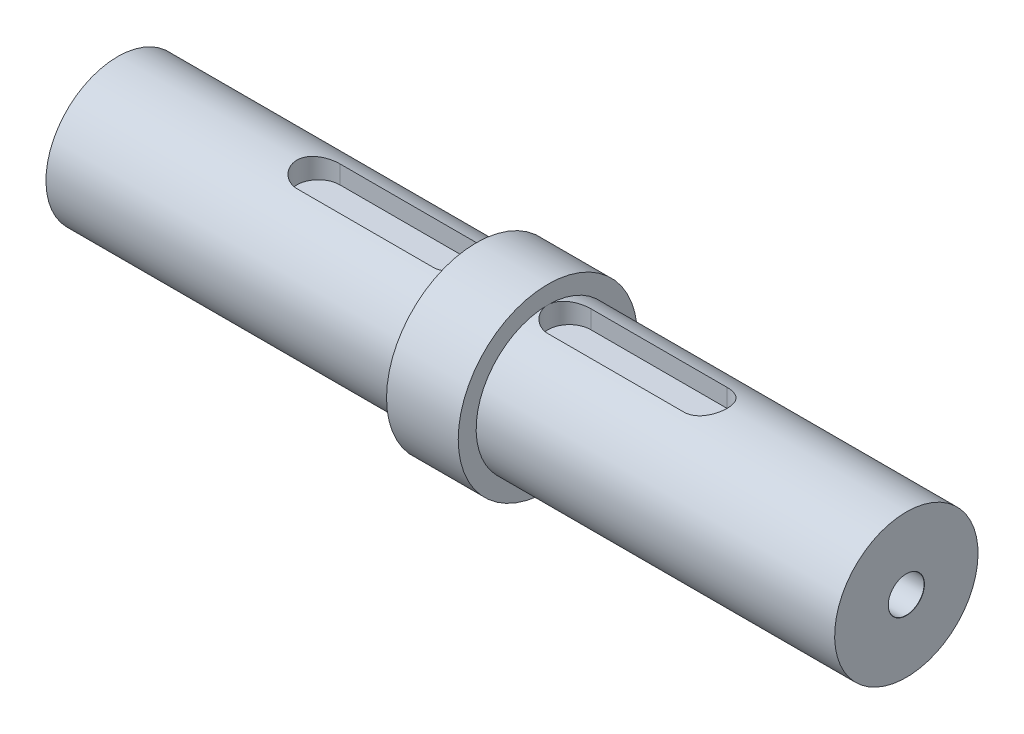
ISO-10303-21;
HEADER;
FILE_DESCRIPTION(('STEP AP214'),'2;1');
FILE_NAME('part.step','',(''),(''),'','','');
FILE_SCHEMA(('AUTOMOTIVE_DESIGN { 1 0 10303 214 1 1 1 1 }'));
ENDSEC;
DATA;
#1=APPLICATION_CONTEXT('core data for automotive mechanical design processes');
#2=APPLICATION_PROTOCOL_DEFINITION('international standard','automotive_design',2000,#1);
#3=PRODUCT_CONTEXT('',#1,'mechanical');
#4=PRODUCT('Part','Part','',(#3));
#5=PRODUCT_RELATED_PRODUCT_CATEGORY('part','',(#4));
#6=PRODUCT_DEFINITION_FORMATION('','',#4);
#7=PRODUCT_DEFINITION_CONTEXT('part definition',#1,'design');
#8=PRODUCT_DEFINITION('design','',#6,#7);
#9=PRODUCT_DEFINITION_SHAPE('','',#8);
#10=(LENGTH_UNIT() NAMED_UNIT(*) SI_UNIT(.MILLI.,.METRE.));
#11=(NAMED_UNIT(*) PLANE_ANGLE_UNIT() SI_UNIT($,.RADIAN.));
#12=(NAMED_UNIT(*) SI_UNIT($,.STERADIAN.) SOLID_ANGLE_UNIT());
#13=UNCERTAINTY_MEASURE_WITH_UNIT(LENGTH_MEASURE(1.E-05),#10,'distance_accuracy_value','');
#14=(GEOMETRIC_REPRESENTATION_CONTEXT(3) GLOBAL_UNCERTAINTY_ASSIGNED_CONTEXT((#13)) GLOBAL_UNIT_ASSIGNED_CONTEXT((#10,
#11,#12)) REPRESENTATION_CONTEXT('',''));
#15=CARTESIAN_POINT('',(0.,0.,0.));
#16=DIRECTION('',(0.,0.,1.));
#17=DIRECTION('',(1.,0.,0.));
#18=AXIS2_PLACEMENT_3D('',#15,#16,#17);
#19=CARTESIAN_POINT('',(0.,0.,0.));
#20=DIRECTION('',(-1.,0.,0.));
#21=DIRECTION('',(0.,-1.,0.));
#22=AXIS2_PLACEMENT_3D('',#19,#20,#21);
#23=PLANE('',#22);
#24=CARTESIAN_POINT('',(0.,0.,0.));
#25=DIRECTION('',(-1.,0.,0.));
#26=DIRECTION('',(0.,0.,1.));
#27=AXIS2_PLACEMENT_3D('',#24,#25,#26);
#28=CIRCLE('',#27,2.525);
#29=CARTESIAN_POINT('',(0.,0.,2.525));
#30=VERTEX_POINT('',#29);
#31=EDGE_CURVE('E125',#30,#30,#28,.T.);
#32=ORIENTED_EDGE('',*,*,#31,.F.);
#33=EDGE_LOOP('',(#32));
#34=FACE_BOUND('',#33,.T.);
#35=CARTESIAN_POINT('',(0.,0.,0.));
#36=DIRECTION('',(1.,0.,0.));
#37=DIRECTION('',(0.,1.,0.));
#38=AXIS2_PLACEMENT_3D('',#35,#36,#37);
#39=CIRCLE('',#38,10.);
#40=CARTESIAN_POINT('',(0.,10.,0.));
#41=VERTEX_POINT('',#40);
#42=EDGE_CURVE('E224',#41,#41,#39,.T.);
#43=ORIENTED_EDGE('',*,*,#42,.F.);
#44=EDGE_LOOP('',(#43));
#45=FACE_BOUND('',#44,.T.);
#46=ADVANCED_FACE('F33',(#34,#45),#23,.T.);
#47=CARTESIAN_POINT('',(110.,0.,0.));
#48=DIRECTION('',(1.,0.,0.));
#49=DIRECTION('',(0.,1.,0.));
#50=AXIS2_PLACEMENT_3D('',#47,#48,#49);
#51=CYLINDRICAL_SURFACE('',#50,9.99999999999999);
#52=CARTESIAN_POINT('',(28.,9.53939201416945,-3.));
#53=CARTESIAN_POINT('',(27.9176644791773,9.53938054248206,-3.00001027845727));
#54=CARTESIAN_POINT('',(27.8353355449368,9.54045772064377,-2.99661062684472));
#55=CARTESIAN_POINT('',(27.6713060472345,9.54470412105985,-2.98307142899347));
#56=CARTESIAN_POINT('',(27.5896053466756,9.54787287296848,-2.97293339805418));
#57=CARTESIAN_POINT('',(27.4276150843268,9.55620668351002,-2.94603140625045));
#58=CARTESIAN_POINT('',(27.347322475957,9.56136667250113,-2.92928426957737));
#59=CARTESIAN_POINT('',(27.1885241558658,9.57351626651177,-2.88932853030394));
#60=CARTESIAN_POINT('',(27.1100184909326,9.58050591937827,-2.8661197587264));
#61=CARTESIAN_POINT('',(26.8780506120099,9.60391637654136,-2.78708584446024));
#62=CARTESIAN_POINT('',(26.727931561167,9.6227900783039,-2.72181852542972));
#63=CARTESIAN_POINT('',(26.440773956021,9.66493213967818,-2.56815043531275));
#64=CARTESIAN_POINT('',(26.3037415292378,9.6882025429064,-2.4797388992416));
#65=CARTESIAN_POINT('',(26.0422770120522,9.73733650515373,-2.27929879634442));
#66=CARTESIAN_POINT('',(25.9183151259391,9.76325505469873,-2.16666914746584));
#67=CARTESIAN_POINT('',(25.6907263851612,9.81429628475076,-1.92227736150433));
#68=CARTESIAN_POINT('',(25.587102966139,9.83941883019409,-1.79051199848163));
#69=CARTESIAN_POINT('',(25.4010731349054,9.88666477976533,-1.50821997465697));
#70=CARTESIAN_POINT('',(25.3191498202174,9.90871541546877,-1.35736167401015));
#71=CARTESIAN_POINT('',(25.1820229959971,9.94668940088143,-1.04324233568303));
#72=CARTESIAN_POINT('',(25.126812596632,9.96261433032402,-0.879984508687982));
#73=CARTESIAN_POINT('',(25.046240448209,9.98615279768396,-0.550649404820599));
#74=CARTESIAN_POINT('',(25.0200702964824,9.99399098526791,-0.3847862530162));
#75=CARTESIAN_POINT('',(24.995765304854,10.0012640407204,-0.0508471415689253));
#76=CARTESIAN_POINT('',(24.9976251573218,10.0007004995012,0.117228393125341));
#77=CARTESIAN_POINT('',(25.0287858206914,9.99139205125585,0.445143199271826));
#78=CARTESIAN_POINT('',(25.0572106908081,9.98290831016511,0.60507429076303));
#79=CARTESIAN_POINT('',(25.1392632696255,9.95903027401821,0.917780104370315));
#80=CARTESIAN_POINT('',(25.1928922986827,9.94363561692557,1.07055445110879));
#81=CARTESIAN_POINT('',(25.3244244435247,9.90730429851781,1.36669563173912));
#82=CARTESIAN_POINT('',(25.4026032887761,9.88630511384913,1.50993201207613));
#83=CARTESIAN_POINT('',(25.5807971800344,9.84099249303646,1.781531059161));
#84=CARTESIAN_POINT('',(25.6808171189407,9.81667831471805,1.90989038323251));
#85=CARTESIAN_POINT('',(25.9043839761846,9.76623347142779,2.15330901082206));
#86=CARTESIAN_POINT('',(26.0286877275262,9.74006890899096,2.26766702955976));
#87=CARTESIAN_POINT('',(26.2949948468511,9.68968430229326,2.47413538985067));
#88=CARTESIAN_POINT('',(26.4370033607298,9.66546482675132,2.5662392402618));
#89=CARTESIAN_POINT('',(26.7365618568999,9.62154457591302,2.72632814481702));
#90=CARTESIAN_POINT('',(26.8942543591871,9.60189192491894,2.79406012682263));
#91=CARTESIAN_POINT('',(27.2194490079631,9.56991327306401,2.90171772009405));
#92=CARTESIAN_POINT('',(27.3869357214287,9.55757606951748,2.94168586436073));
#93=CARTESIAN_POINT('',(27.6299897781404,9.5462806465001,2.97802407180159));
#94=CARTESIAN_POINT('',(27.7037814683592,9.54370312550532,2.98626405978018));
#95=CARTESIAN_POINT('',(27.851702958199,9.54025857223563,2.99724711229709));
#96=CARTESIAN_POINT('',(27.9258320993277,9.53938902493286,2.99999825936538));
#97=CARTESIAN_POINT('',(28.,9.53939201416944,3.));
#98=B_SPLINE_CURVE_WITH_KNOTS('',3,(#52,#53,#54,#55,#56,#57,#58,#59,#60,#61,#62,#63,#64,#65,#66,
#67,#68,#69,#70,#71,#72,#73,#74,#75,#76,#77,#78,#79,#80,#81,#82,#83,#84,#85,#86,#87,#88,#89,#90,
#91,#92,#93,#94,#95,#96,#97),.UNSPECIFIED.,.F.,.F.,(4,2,2,2,2,2,2,2,2,2,2,2,2,2,2,2,2,2,2,2,2,2,
4),(0.,0.246918142439467,0.493780777706087,0.740019009623012,0.986263681482023,1.47813347402025,
1.97023245590779,2.47635119822766,2.98255536239033,3.4992281062007,4.01576751791672,
4.51753600864764,5.019209488041,5.50490358251092,5.99062312360831,6.48200583350621,
6.97349873739169,7.48389234847122,7.99443465298714,8.51013494368214,9.02504345105574,
9.24774267716777,9.47011372732391),.UNSPECIFIED.);
#99=CARTESIAN_POINT('',(28.,9.53939201416945,-3.));
#100=VERTEX_POINT('',#99);
#101=CARTESIAN_POINT('',(28.,9.53939201416944,3.));
#102=VERTEX_POINT('',#101);
#103=EDGE_CURVE('E289',#100,#102,#98,.T.);
#104=ORIENTED_EDGE('',*,*,#103,.F.);
#105=DIRECTION('',(1.,0.,0.));
#106=VECTOR('',#105,1.);
#107=CARTESIAN_POINT('',(110.,9.53939201416944,-3.));
#108=LINE('',#107,#106);
#109=CARTESIAN_POINT('',(46.9999999999999,9.53939201416943,-3.00000000000007));
#110=VERTEX_POINT('',#109);
#111=EDGE_CURVE('E11',#110,#100,#108,.F.);
#112=ORIENTED_EDGE('',*,*,#111,.F.);
#113=CARTESIAN_POINT('',(44.,9.99999999999999,0.));
#114=CARTESIAN_POINT('',(44.0000019949698,9.999998585011,0.1645772255066));
#115=CARTESIAN_POINT('',(44.0135877272479,9.99589831387906,0.329174636703059));
#116=CARTESIAN_POINT('',(44.0674427084442,9.97994211187381,0.653576250609761));
#117=CARTESIAN_POINT('',(44.1077199160467,9.96808386779383,0.813379008822839));
#118=CARTESIAN_POINT('',(44.2134920338205,9.93791105003672,1.12346541550905));
#119=CARTESIAN_POINT('',(44.2789497392379,9.9196060050085,1.27376272879074));
#120=CARTESIAN_POINT('',(44.4330721861117,9.8784421847529,1.56124836210626));
#121=CARTESIAN_POINT('',(44.5217400147908,9.85558280384132,1.69843493493934));
#122=CARTESIAN_POINT('',(44.7224480149453,9.80701474385547,1.95974359436749));
#123=CARTESIAN_POINT('',(44.8350332517718,9.78124767314072,2.08343614248868));
#124=CARTESIAN_POINT('',(45.0792184598204,9.73011668420883,2.31049841846647));
#125=CARTESIAN_POINT('',(45.2108216242499,9.70475283449002,2.41386472654881));
#126=CARTESIAN_POINT('',(45.4929415060752,9.65668227987543,2.59960075447415));
#127=CARTESIAN_POINT('',(45.6438169219815,9.63404813327748,2.68144618044427));
#128=CARTESIAN_POINT('',(45.9579785084606,9.59487240788061,2.8184278954952));
#129=CARTESIAN_POINT('',(46.1212616878559,9.5783293662662,2.87357059839946));
#130=CARTESIAN_POINT('',(46.4507805322609,9.55381741676868,2.95403267365303));
#131=CARTESIAN_POINT('',(46.6168054877279,9.54562138649066,2.98014392469355));
#132=CARTESIAN_POINT('',(46.9510663124335,9.53805579499533,3.00427461229344));
#133=CARTESIAN_POINT('',(47.1193016361182,9.53868409521141,3.00230085522157));
#134=CARTESIAN_POINT('',(47.446767817217,9.54849488135554,2.97093954399623));
#135=CARTESIAN_POINT('',(47.6061045007245,9.5573677719828,2.9425441052537));
#136=CARTESIAN_POINT('',(47.9176395725469,9.58216712457247,2.86074840854112));
#137=CARTESIAN_POINT('',(48.0698372547487,9.598094282647,2.80734568283282));
#138=CARTESIAN_POINT('',(48.3652006993215,9.63545466149945,2.67632053307363));
#139=CARTESIAN_POINT('',(48.5082141679105,9.65696032231903,2.59837633869285));
#140=CARTESIAN_POINT('',(48.7794640440204,9.70301974000128,2.42070445177367));
#141=CARTESIAN_POINT('',(48.9076968588276,9.72757423493981,2.32097148005177));
#142=CARTESIAN_POINT('',(49.151372381524,9.77822022595874,2.09762581531093));
#143=CARTESIAN_POINT('',(49.2660573280593,9.80433308620995,1.97318981493394));
#144=CARTESIAN_POINT('',(49.4731079681285,9.85424488126516,1.70652651862794));
#145=CARTESIAN_POINT('',(49.5654722568289,9.87804367036819,1.56429810372178));
#146=CARTESIAN_POINT('',(49.7257198449295,9.9208632013894,1.26471007668561));
#147=CARTESIAN_POINT('',(49.7934350324997,9.93985087336627,1.1072554994959));
#148=CARTESIAN_POINT('',(49.9011991801993,9.97067043664443,0.782490831207039));
#149=CARTESIAN_POINT('',(49.941255857065,9.98250432373998,0.615183503179165));
#150=CARTESIAN_POINT('',(49.9913043557988,9.99736729287076,0.281904485336666));
#151=CARTESIAN_POINT('',(50.0023231716032,10.0006970083558,0.116100195202377));
#152=CARTESIAN_POINT('',(49.9968616885758,9.99905846483518,-0.214999211646763));
#153=CARTESIAN_POINT('',(49.9803850606971,9.99409131355513,-0.380294393381558));
#154=CARTESIAN_POINT('',(49.921230777777,9.97661393974323,-0.70180721061939));
#155=CARTESIAN_POINT('',(49.8791532248383,9.96427659598828,-0.858145545228335));
#156=CARTESIAN_POINT('',(49.7707135344436,9.93348695683069,-1.16150927790904));
#157=CARTESIAN_POINT('',(49.7043484779243,9.91503392642187,-1.30853355405116));
#158=CARTESIAN_POINT('',(49.5474936690377,9.8733930870263,-1.5928743789221));
#159=CARTESIAN_POINT('',(49.456481318104,9.85010561659279,-1.72988765239933));
#160=CARTESIAN_POINT('',(49.2535504918944,9.80146937528704,-1.98704661596029));
#161=CARTESIAN_POINT('',(49.1416267762247,9.77612008862419,-2.10718806471188));
#162=CARTESIAN_POINT('',(48.8952253832613,9.72506343738006,-2.33171489102052));
#163=CARTESIAN_POINT('',(48.7600762484564,9.69937650065512,-2.43536962463001));
#164=CARTESIAN_POINT('',(48.4737441219731,9.65153030477948,-2.61857990144313));
#165=CARTESIAN_POINT('',(48.3225615508842,9.6293709531312,-2.69813607658965));
#166=CARTESIAN_POINT('',(48.00893501749,9.59134379226309,-2.83034694254315));
#167=CARTESIAN_POINT('',(47.8465476269243,9.575446756735,-2.88312693874021));
#168=CARTESIAN_POINT('',(47.5146240621395,9.55183188739736,-2.96043461630306));
#169=CARTESIAN_POINT('',(47.3450903584339,9.54411125069386,-2.98497197957849));
#170=CARTESIAN_POINT('',(47.0112769632232,9.53799944941557,-3.0044396896993));
#171=CARTESIAN_POINT('',(46.8470726979012,9.53923294700394,-3.00056110615887));
#172=CARTESIAN_POINT('',(46.5217717931988,9.54998802392188,-2.9661501088861));
#173=CARTESIAN_POINT('',(46.360675029639,9.55950927135901,-2.93561876249407));
#174=CARTESIAN_POINT('',(46.0481092017367,9.58551527389242,-2.84953777608686));
#175=CARTESIAN_POINT('',(45.8965454252826,9.60191209104933,-2.79430351014248));
#176=CARTESIAN_POINT('',(45.6047151223586,9.63980557805264,-2.66063014242148));
#177=CARTESIAN_POINT('',(45.4644507647169,9.66130322385079,-2.58218659925722));
#178=CARTESIAN_POINT('',(45.1936737669475,9.70795352855337,-2.40097527610175));
#179=CARTESIAN_POINT('',(45.0637024774796,9.73321080328579,-2.29742552185996));
#180=CARTESIAN_POINT('',(44.8225950033838,9.78402640899065,-2.07034869259555));
#181=CARTESIAN_POINT('',(44.7114637210644,9.80958481647542,-1.94681643426898));
#182=CARTESIAN_POINT('',(44.5079531754101,9.85901873141572,-1.67893152436652));
#183=CARTESIAN_POINT('',(44.4162171062891,9.88282319531421,-1.53407577158122));
#184=CARTESIAN_POINT('',(44.2585296601919,9.92521360911552,-1.23028274796705));
#185=CARTESIAN_POINT('',(44.192566223451,9.94380199862113,-1.07135210599791));
#186=CARTESIAN_POINT('',(44.0942094486945,9.97204349938617,-0.761515425310562));
#187=CARTESIAN_POINT('',(44.0589766542335,9.98244054762139,-0.611573923908467));
#188=CARTESIAN_POINT('',(44.0118729495168,9.99641888988979,-0.307760390461558));
#189=CARTESIAN_POINT('',(43.9999981345904,10.0000013230948,-0.153889019716279));
#190=CARTESIAN_POINT('',(44.,9.99999999999999,0.));
#191=B_SPLINE_CURVE_WITH_KNOTS('',3,(#113,#114,#115,#116,#117,#118,#119,#120,#121,#122,#123,
#124,#125,#126,#127,#128,#129,#130,#131,#132,#133,#134,#135,#136,#137,#138,#139,#140,#141,#142,
#143,#144,#145,#146,#147,#148,#149,#150,#151,#152,#153,#154,#155,#156,#157,#158,#159,#160,#161,
#162,#163,#164,#165,#166,#167,#168,#169,#170,#171,#172,#173,#174,#175,#176,#177,#178,#179,#180,
#181,#182,#183,#184,#185,#186,#187,#188,#189,#190),.UNSPECIFIED.,.T.,.F.,(4,2,2,2,2,2,2,2,2,2,2,
2,2,2,2,2,2,2,2,2,2,2,2,2,2,2,2,2,2,2,2,2,2,2,2,2,2,2,4),(0.,0.493166407225221,
0.986479929691998,1.47906735260175,1.9717203288254,2.47711205896382,2.98258874577265,
3.49942962008218,4.01614629086447,4.51839378713198,5.02051956638179,5.50452033395353,
5.98856887316003,6.47924852894239,6.97004720317111,7.48134208096334,7.99266913062143,
8.50742093763377,9.02202907057615,9.5181761887709,10.0142570710065,10.4991349336465,
10.9840710918746,11.4802261140582,11.9765056400038,12.4908080064564,13.0050968850536,
13.516956299025,14.0286401892057,14.5190031093854,15.0093463933232,15.4936008081456,
15.9779479511533,16.4799385136898,16.9820594980412,17.4988599232246,18.0154182319959,
18.4766338387004,18.9377723390687),.UNSPECIFIED.);
#192=CARTESIAN_POINT('',(50.,10.,0.));
#193=VERTEX_POINT('',#192);
#194=EDGE_CURVE('E151',#193,#110,#191,.T.);
#195=ORIENTED_EDGE('',*,*,#194,.F.);
#196=CARTESIAN_POINT('',(50.,0.,0.));
#197=DIRECTION('',(1.,0.,0.));
#198=DIRECTION('',(0.,1.,0.));
#199=AXIS2_PLACEMENT_3D('',#196,#197,#198);
#200=CIRCLE('',#199,9.99999999999998);
#201=EDGE_CURVE('E266',#193,#193,#200,.T.);
#202=ORIENTED_EDGE('',*,*,#201,.F.);
#203=CARTESIAN_POINT('',(47.,9.53939201416945,3.));
#204=VERTEX_POINT('',#203);
#205=EDGE_CURVE('E184',#204,#193,#191,.T.);
#206=ORIENTED_EDGE('',*,*,#205,.F.);
#207=DIRECTION('',(1.,0.,0.));
#208=VECTOR('',#207,1.);
#209=CARTESIAN_POINT('',(110.,9.53939201416945,2.99999999999999));
#210=LINE('',#209,#208);
#211=EDGE_CURVE('E40',#102,#204,#210,.T.);
#212=ORIENTED_EDGE('',*,*,#211,.F.);
#213=EDGE_LOOP('',(#104,#112,#195,#202,#206,#212));
#214=FACE_BOUND('',#213,.T.);
#215=ORIENTED_EDGE('',*,*,#42,.T.);
#216=EDGE_LOOP('',(#215));
#217=FACE_BOUND('',#216,.T.);
#218=ADVANCED_FACE('F187',(#214,#217),#51,.T.);
#219=CARTESIAN_POINT('',(50.,9.99999999999998,0.));
#220=DIRECTION('',(-1.,0.,0.));
#221=DIRECTION('',(0.,-1.,0.));
#222=AXIS2_PLACEMENT_3D('',#219,#220,#221);
#223=PLANE('',#222);
#224=ORIENTED_EDGE('',*,*,#201,.T.);
#225=EDGE_LOOP('',(#224));
#226=FACE_BOUND('',#225,.T.);
#227=CARTESIAN_POINT('',(50.,0.,0.));
#228=DIRECTION('',(1.,0.,0.));
#229=DIRECTION('',(0.,1.,0.));
#230=AXIS2_PLACEMENT_3D('',#227,#228,#229);
#231=CIRCLE('',#230,12.5);
#232=CARTESIAN_POINT('',(50.,12.5,0.));
#233=VERTEX_POINT('',#232);
#234=EDGE_CURVE('E268',#233,#233,#231,.T.);
#235=ORIENTED_EDGE('',*,*,#234,.F.);
#236=EDGE_LOOP('',(#235));
#237=FACE_BOUND('',#236,.T.);
#238=ADVANCED_FACE('F258',(#226,#237),#223,.T.);
#239=CARTESIAN_POINT('',(110.,0.,0.));
#240=DIRECTION('',(1.,0.,0.));
#241=DIRECTION('',(0.,1.,0.));
#242=AXIS2_PLACEMENT_3D('',#239,#240,#241);
#243=CYLINDRICAL_SURFACE('',#242,12.5);
#244=ORIENTED_EDGE('',*,*,#234,.T.);
#245=EDGE_LOOP('',(#244));
#246=FACE_BOUND('',#245,.T.);
#247=CARTESIAN_POINT('',(60.,0.,0.));
#248=DIRECTION('',(1.,0.,0.));
#249=DIRECTION('',(0.,1.,0.));
#250=AXIS2_PLACEMENT_3D('',#247,#248,#249);
#251=CIRCLE('',#250,12.5);
#252=CARTESIAN_POINT('',(60.,12.5,0.));
#253=VERTEX_POINT('',#252);
#254=EDGE_CURVE('E272',#253,#253,#251,.T.);
#255=ORIENTED_EDGE('',*,*,#254,.F.);
#256=EDGE_LOOP('',(#255));
#257=FACE_BOUND('',#256,.T.);
#258=ADVANCED_FACE('F408',(#246,#257),#243,.T.);
#259=CARTESIAN_POINT('',(60.,12.5,0.));
#260=DIRECTION('',(1.,0.,0.));
#261=DIRECTION('',(0.,1.,0.));
#262=AXIS2_PLACEMENT_3D('',#259,#260,#261);
#263=PLANE('',#262);
#264=ORIENTED_EDGE('',*,*,#254,.T.);
#265=EDGE_LOOP('',(#264));
#266=FACE_BOUND('',#265,.T.);
#267=CARTESIAN_POINT('',(60.,0.,0.));
#268=DIRECTION('',(1.,0.,0.));
#269=DIRECTION('',(0.,1.,0.));
#270=AXIS2_PLACEMENT_3D('',#267,#268,#269);
#271=CIRCLE('',#270,9.99999999999999);
#272=CARTESIAN_POINT('',(60.,10.,0.));
#273=VERTEX_POINT('',#272);
#274=EDGE_CURVE('E276',#273,#273,#271,.T.);
#275=ORIENTED_EDGE('',*,*,#274,.F.);
#276=EDGE_LOOP('',(#275));
#277=FACE_BOUND('',#276,.T.);
#278=ADVANCED_FACE('F233',(#266,#277),#263,.T.);
#279=CARTESIAN_POINT('',(110.,0.,0.));
#280=DIRECTION('',(1.,0.,0.));
#281=DIRECTION('',(0.,1.,0.));
#282=AXIS2_PLACEMENT_3D('',#279,#280,#281);
#283=CYLINDRICAL_SURFACE('',#282,9.99999999999999);
#284=CARTESIAN_POINT('',(79.,9.99999999999999,0.));
#285=CARTESIAN_POINT('',(79.0000019949698,9.999998585011,0.1645772255066));
#286=CARTESIAN_POINT('',(79.0135877272479,9.99589831387907,0.329174636703058));
#287=CARTESIAN_POINT('',(79.0674427084442,9.97994211187381,0.65357625060976));
#288=CARTESIAN_POINT('',(79.1077199160467,9.96808386779384,0.813379008822838));
#289=CARTESIAN_POINT('',(79.2134920338205,9.93791105003672,1.12346541550905));
#290=CARTESIAN_POINT('',(79.2789497392379,9.9196060050085,1.27376272879074));
#291=CARTESIAN_POINT('',(79.4330721861117,9.8784421847529,1.56124836210626));
#292=CARTESIAN_POINT('',(79.5217400147908,9.85558280384133,1.69843493493933));
#293=CARTESIAN_POINT('',(79.7224480149453,9.80701474385548,1.95974359436749));
#294=CARTESIAN_POINT('',(79.8350332517718,9.78124767314072,2.08343614248868));
#295=CARTESIAN_POINT('',(80.0792184598204,9.73011668420884,2.31049841846647));
#296=CARTESIAN_POINT('',(80.2108216242499,9.70475283449002,2.41386472654881));
#297=CARTESIAN_POINT('',(80.4929415060752,9.65668227987543,2.59960075447415));
#298=CARTESIAN_POINT('',(80.6438169219815,9.63404813327748,2.68144618044427));
#299=CARTESIAN_POINT('',(80.9579785084606,9.59487240788061,2.8184278954952));
#300=CARTESIAN_POINT('',(81.1212616878559,9.57832936626621,2.87357059839946));
#301=CARTESIAN_POINT('',(81.4507805322609,9.55381741676868,2.95403267365303));
#302=CARTESIAN_POINT('',(81.6168054877279,9.54562138649066,2.98014392469354));
#303=CARTESIAN_POINT('',(81.9510663124335,9.53805579499534,3.00427461229344));
#304=CARTESIAN_POINT('',(82.1193016361182,9.53868409521142,3.00230085522156));
#305=CARTESIAN_POINT('',(82.446767817217,9.54849488135555,2.97093954399623));
#306=CARTESIAN_POINT('',(82.6061045007245,9.55736777198281,2.9425441052537));
#307=CARTESIAN_POINT('',(82.9176395725469,9.58216712457248,2.86074840854111));
#308=CARTESIAN_POINT('',(83.0698372547487,9.59809428264701,2.80734568283282));
#309=CARTESIAN_POINT('',(83.3652006993215,9.63545466149945,2.67632053307363));
#310=CARTESIAN_POINT('',(83.5082141679105,9.65696032231904,2.59837633869285));
#311=CARTESIAN_POINT('',(83.7794640440204,9.70301974000128,2.42070445177366));
#312=CARTESIAN_POINT('',(83.9076968588275,9.72757423493981,2.32097148005177));
#313=CARTESIAN_POINT('',(84.151372381524,9.77822022595874,2.09762581531092));
#314=CARTESIAN_POINT('',(84.2660573280593,9.80433308620995,1.97318981493394));
#315=CARTESIAN_POINT('',(84.4731079681285,9.85424488126517,1.70652651862793));
#316=CARTESIAN_POINT('',(84.5654722568288,9.87804367036819,1.56429810372177));
#317=CARTESIAN_POINT('',(84.7257198449295,9.9208632013894,1.2647100766856));
#318=CARTESIAN_POINT('',(84.7934350324997,9.93985087336627,1.10725549949589));
#319=CARTESIAN_POINT('',(84.9011991801992,9.97067043664443,0.782490831207033));
#320=CARTESIAN_POINT('',(84.941255857065,9.98250432373998,0.615183503179159));
#321=CARTESIAN_POINT('',(84.9913043557988,9.99736729287076,0.281904485336661));
#322=CARTESIAN_POINT('',(85.0023231716032,10.0006970083558,0.116100195202372));
#323=CARTESIAN_POINT('',(84.9968616885758,9.99905846483519,-0.214999211646768));
#324=CARTESIAN_POINT('',(84.9803850606971,9.99409131355513,-0.380294393381563));
#325=CARTESIAN_POINT('',(84.921230777777,9.97661393974324,-0.701807210619392));
#326=CARTESIAN_POINT('',(84.8791532248382,9.96427659598828,-0.858145545228335));
#327=CARTESIAN_POINT('',(84.7707135344436,9.93348695683069,-1.16150927790904));
#328=CARTESIAN_POINT('',(84.7043484779243,9.91503392642187,-1.30853355405117));
#329=CARTESIAN_POINT('',(84.5474936690377,9.8733930870263,-1.59287437892211));
#330=CARTESIAN_POINT('',(84.456481318104,9.8501056165928,-1.72988765239934));
#331=CARTESIAN_POINT('',(84.2535504918944,9.80146937528704,-1.9870466159603));
#332=CARTESIAN_POINT('',(84.1416267762247,9.77612008862419,-2.10718806471189));
#333=CARTESIAN_POINT('',(83.8952253832613,9.72506343738006,-2.33171489102053));
#334=CARTESIAN_POINT('',(83.7600762484563,9.69937650065512,-2.43536962463002));
#335=CARTESIAN_POINT('',(83.4737441219731,9.65153030477948,-2.61857990144313));
#336=CARTESIAN_POINT('',(83.3225615508842,9.6293709531312,-2.69813607658965));
#337=CARTESIAN_POINT('',(83.0089350174899,9.59134379226309,-2.83034694254316));
#338=CARTESIAN_POINT('',(82.8465476269243,9.575446756735,-2.88312693874021));
#339=CARTESIAN_POINT('',(82.5146240621395,9.55183188739736,-2.96043461630306));
#340=CARTESIAN_POINT('',(82.3450903584339,9.54411125069386,-2.98497197957849));
#341=CARTESIAN_POINT('',(82.0112769632232,9.53799944941558,-3.0044396896993));
#342=CARTESIAN_POINT('',(81.8470726979012,9.53923294700394,-3.00056110615887));
#343=CARTESIAN_POINT('',(81.5217717931988,9.54998802392188,-2.96615010888611));
#344=CARTESIAN_POINT('',(81.360675029639,9.55950927135901,-2.93561876249408));
#345=CARTESIAN_POINT('',(81.0481092017367,9.58551527389242,-2.84953777608686));
#346=CARTESIAN_POINT('',(80.8965454252826,9.60191209104933,-2.79430351014248));
#347=CARTESIAN_POINT('',(80.6047151223585,9.63980557805265,-2.66063014242148));
#348=CARTESIAN_POINT('',(80.4644507647168,9.6613032238508,-2.58218659925722));
#349=CARTESIAN_POINT('',(80.1936737669475,9.70795352855337,-2.40097527610176));
#350=CARTESIAN_POINT('',(80.0637024774796,9.73321080328579,-2.29742552185996));
#351=CARTESIAN_POINT('',(79.8225950033838,9.78402640899066,-2.07034869259556));
#352=CARTESIAN_POINT('',(79.7114637210643,9.80958481647542,-1.94681643426898));
#353=CARTESIAN_POINT('',(79.5079531754101,9.85901873141572,-1.67893152436652));
#354=CARTESIAN_POINT('',(79.416217106289,9.88282319531421,-1.53407577158122));
#355=CARTESIAN_POINT('',(79.2585296601919,9.92521360911552,-1.23028274796706));
#356=CARTESIAN_POINT('',(79.192566223451,9.94380199862114,-1.07135210599791));
#357=CARTESIAN_POINT('',(79.0942094486945,9.97204349938618,-0.761515425310569));
#358=CARTESIAN_POINT('',(79.0589766542335,9.98244054762139,-0.611573923908473));
#359=CARTESIAN_POINT('',(79.0118729495168,9.99641888988979,-0.307760390461561));
#360=CARTESIAN_POINT('',(78.9999981345903,10.0000013230948,-0.15388901971628));
#361=CARTESIAN_POINT('',(79.,9.99999999999999,0.));
#362=B_SPLINE_CURVE_WITH_KNOTS('',3,(#284,#285,#286,#287,#288,#289,#290,#291,#292,#293,#294,
#295,#296,#297,#298,#299,#300,#301,#302,#303,#304,#305,#306,#307,#308,#309,#310,#311,#312,#313,
#314,#315,#316,#317,#318,#319,#320,#321,#322,#323,#324,#325,#326,#327,#328,#329,#330,#331,#332,
#333,#334,#335,#336,#337,#338,#339,#340,#341,#342,#343,#344,#345,#346,#347,#348,#349,#350,#351,
#352,#353,#354,#355,#356,#357,#358,#359,#360,#361),.UNSPECIFIED.,.T.,.F.,(4,2,2,2,2,2,2,2,2,2,2,
2,2,2,2,2,2,2,2,2,2,2,2,2,2,2,2,2,2,2,2,2,2,2,2,2,2,2,4),(0.,0.493166407225221,
0.986479929691996,1.47906735260174,1.9717203288254,2.47711205896382,2.98258874577266,
3.49942962008219,4.01614629086447,4.51839378713198,5.02051956638178,5.50452033395352,
5.98856887316002,6.47924852894238,6.9700472031711,7.48134208096333,7.99266913062143,
8.50742093763377,9.02202907057615,9.51817618877089,10.0142570710065,10.4991349336465,
10.9840710918746,11.4802261140582,11.9765056400038,12.4908080064564,13.0050968850536,
13.516956299025,14.0286401892056,14.5190031093854,15.0093463933232,15.4936008081456,
15.9779479511533,16.4799385136898,16.9820594980412,17.4988599232246,18.0154182319959,
18.4766338387004,18.9377723390687),.UNSPECIFIED.);
#363=CARTESIAN_POINT('',(82.,9.53939201416945,3.));
#364=VERTEX_POINT('',#363);
#365=CARTESIAN_POINT('',(82.,9.53939201416945,-3.));
#366=VERTEX_POINT('',#365);
#367=EDGE_CURVE('E216',#364,#366,#362,.T.);
#368=ORIENTED_EDGE('',*,*,#367,.F.);
#369=DIRECTION('',(1.,0.,0.));
#370=VECTOR('',#369,1.);
#371=CARTESIAN_POINT('',(110.,9.53939201416945,3.));
#372=LINE('',#371,#370);
#373=CARTESIAN_POINT('',(63.,9.53939201416945,3.));
#374=VERTEX_POINT('',#373);
#375=EDGE_CURVE('E244',#374,#364,#372,.T.);
#376=ORIENTED_EDGE('',*,*,#375,.F.);
#377=CARTESIAN_POINT('',(63.,9.53939201416945,-3.));
#378=CARTESIAN_POINT('',(62.9176644791773,9.53938054248206,-3.00001027845728));
#379=CARTESIAN_POINT('',(62.8353355449368,9.54045772064378,-2.99661062684472));
#380=CARTESIAN_POINT('',(62.6713060472345,9.54470412105985,-2.98307142899347));
#381=CARTESIAN_POINT('',(62.5896053466756,9.54787287296848,-2.97293339805418));
#382=CARTESIAN_POINT('',(62.4276150843268,9.55620668351002,-2.94603140625045));
#383=CARTESIAN_POINT('',(62.347322475957,9.56136667250114,-2.92928426957737));
#384=CARTESIAN_POINT('',(62.1885241558658,9.57351626651177,-2.88932853030395));
#385=CARTESIAN_POINT('',(62.1100184909326,9.58050591937827,-2.86611975872641));
#386=CARTESIAN_POINT('',(61.8780506120099,9.60391637654136,-2.78708584446024));
#387=CARTESIAN_POINT('',(61.727931561167,9.6227900783039,-2.72181852542972));
#388=CARTESIAN_POINT('',(61.440773956021,9.66493213967818,-2.56815043531276));
#389=CARTESIAN_POINT('',(61.3037415292378,9.6882025429064,-2.4797388992416));
#390=CARTESIAN_POINT('',(61.0422770120522,9.73733650515374,-2.27929879634442));
#391=CARTESIAN_POINT('',(60.9183151259391,9.76325505469873,-2.16666914746584));
#392=CARTESIAN_POINT('',(60.6907263851612,9.81429628475076,-1.92227736150433));
#393=CARTESIAN_POINT('',(60.587102966139,9.83941883019409,-1.79051199848164));
#394=CARTESIAN_POINT('',(60.4010731349054,9.88666477976533,-1.50821997465697));
#395=CARTESIAN_POINT('',(60.3191498202174,9.90871541546877,-1.35736167401016));
#396=CARTESIAN_POINT('',(60.1820229959971,9.94668940088143,-1.04324233568303));
#397=CARTESIAN_POINT('',(60.126812596632,9.96261433032402,-0.879984508687985));
#398=CARTESIAN_POINT('',(60.046240448209,9.98615279768397,-0.5506494048206));
#399=CARTESIAN_POINT('',(60.0200702964824,9.99399098526791,-0.384786253016202));
#400=CARTESIAN_POINT('',(59.995765304854,10.0012640407204,-0.0508471415689279));
#401=CARTESIAN_POINT('',(59.9976251573218,10.0007004995012,0.117228393125338));
#402=CARTESIAN_POINT('',(60.0287858206914,9.99139205125585,0.445143199271823));
#403=CARTESIAN_POINT('',(60.0572106908081,9.98290831016511,0.605074290763027));
#404=CARTESIAN_POINT('',(60.1392632696255,9.95903027401822,0.917780104370313));
#405=CARTESIAN_POINT('',(60.1928922986827,9.94363561692557,1.07055445110879));
#406=CARTESIAN_POINT('',(60.3244244435248,9.90730429851781,1.36669563173912));
#407=CARTESIAN_POINT('',(60.4026032887761,9.88630511384914,1.50993201207613));
#408=CARTESIAN_POINT('',(60.5807971800344,9.84099249303646,1.781531059161));
#409=CARTESIAN_POINT('',(60.6808171189407,9.81667831471805,1.90989038323251));
#410=CARTESIAN_POINT('',(60.9043839761846,9.76623347142779,2.15330901082206));
#411=CARTESIAN_POINT('',(61.0286877275262,9.74006890899096,2.26766702955975));
#412=CARTESIAN_POINT('',(61.2949948468511,9.68968430229326,2.47413538985067));
#413=CARTESIAN_POINT('',(61.4370033607298,9.66546482675133,2.5662392402618));
#414=CARTESIAN_POINT('',(61.7365618568999,9.62154457591302,2.72632814481701));
#415=CARTESIAN_POINT('',(61.8942543591871,9.60189192491895,2.79406012682262));
#416=CARTESIAN_POINT('',(62.2194490079631,9.56991327306402,2.90171772009404));
#417=CARTESIAN_POINT('',(62.3869357214287,9.55757606951749,2.94168586436072));
#418=CARTESIAN_POINT('',(62.6299897781404,9.54628064650011,2.97802407180158));
#419=CARTESIAN_POINT('',(62.7037814683592,9.54370312550533,2.98626405978017));
#420=CARTESIAN_POINT('',(62.851702958199,9.54025857223564,2.99724711229708));
#421=CARTESIAN_POINT('',(62.9258320993277,9.53938902493287,2.99999825936538));
#422=CARTESIAN_POINT('',(63.,9.53939201416945,3.));
#423=B_SPLINE_CURVE_WITH_KNOTS('',3,(#377,#378,#379,#380,#381,#382,#383,#384,#385,#386,#387,
#388,#389,#390,#391,#392,#393,#394,#395,#396,#397,#398,#399,#400,#401,#402,#403,#404,#405,#406,
#407,#408,#409,#410,#411,#412,#413,#414,#415,#416,#417,#418,#419,#420,#421,#422),.UNSPECIFIED.,
.F.,.F.,(4,2,2,2,2,2,2,2,2,2,2,2,2,2,2,2,2,2,2,2,2,2,4),(0.,0.246918142439488,0.493780777706094,
0.740019009623013,0.986263681482027,1.47813347402026,1.97023245590779,2.47635119822766,
2.98255536239032,3.4992281062007,4.01576751791672,4.51753600864764,5.019209488041,
5.50490358251093,5.99062312360831,6.48200583350621,6.9734987373917,7.48389234847122,
7.99443465298715,8.51013494368213,9.02504345105573,9.24774267716777,9.47011372732391),.UNSPECIFIED.);
#424=EDGE_CURVE('E237',#273,#374,#423,.T.);
#425=ORIENTED_EDGE('',*,*,#424,.F.);
#426=ORIENTED_EDGE('',*,*,#274,.T.);
#427=CARTESIAN_POINT('',(63.,9.53939201416945,-3.));
#428=VERTEX_POINT('',#427);
#429=EDGE_CURVE('E243',#428,#273,#423,.T.);
#430=ORIENTED_EDGE('',*,*,#429,.F.);
#431=DIRECTION('',(1.,0.,0.));
#432=VECTOR('',#431,1.);
#433=CARTESIAN_POINT('',(110.,9.53939201416945,-3.));
#434=LINE('',#433,#432);
#435=EDGE_CURVE('E223',#366,#428,#434,.F.);
#436=ORIENTED_EDGE('',*,*,#435,.F.);
#437=EDGE_LOOP('',(#368,#376,#425,#426,#430,#436));
#438=FACE_BOUND('',#437,.T.);
#439=CARTESIAN_POINT('',(110.,0.,0.));
#440=DIRECTION('',(1.,0.,0.));
#441=DIRECTION('',(0.,1.,0.));
#442=AXIS2_PLACEMENT_3D('',#439,#440,#441);
#443=CIRCLE('',#442,9.99999999999999);
#444=CARTESIAN_POINT('',(110.,9.99999999999999,0.));
#445=VERTEX_POINT('',#444);
#446=EDGE_CURVE('E185',#445,#445,#443,.T.);
#447=ORIENTED_EDGE('',*,*,#446,.F.);
#448=EDGE_LOOP('',(#447));
#449=FACE_BOUND('',#448,.T.);
#450=ADVANCED_FACE('F227',(#438,#449),#283,.T.);
#451=CARTESIAN_POINT('',(110.,9.99999999999999,0.));
#452=DIRECTION('',(1.,0.,0.));
#453=DIRECTION('',(0.,1.,0.));
#454=AXIS2_PLACEMENT_3D('',#451,#452,#453);
#455=PLANE('',#454);
#456=CARTESIAN_POINT('',(110.,0.,0.));
#457=DIRECTION('',(1.,0.,0.));
#458=DIRECTION('',(0.,0.,-1.));
#459=AXIS2_PLACEMENT_3D('',#456,#457,#458);
#460=CIRCLE('',#459,2.525);
#461=CARTESIAN_POINT('',(110.,0.,-2.525));
#462=VERTEX_POINT('',#461);
#463=EDGE_CURVE('E118',#462,#462,#460,.T.);
#464=ORIENTED_EDGE('',*,*,#463,.F.);
#465=EDGE_LOOP('',(#464));
#466=FACE_BOUND('',#465,.T.);
#467=ORIENTED_EDGE('',*,*,#446,.T.);
#468=EDGE_LOOP('',(#467));
#469=FACE_BOUND('',#468,.T.);
#470=ADVANCED_FACE('F232',(#466,#469),#455,.T.);
#471=CARTESIAN_POINT('',(63.,7.,0.));
#472=DIRECTION('',(0.,1.,0.));
#473=DIRECTION('',(0.,0.,1.));
#474=AXIS2_PLACEMENT_3D('',#471,#472,#473);
#475=CYLINDRICAL_SURFACE('',#474,3.);
#476=ORIENTED_EDGE('',*,*,#429,.T.);
#477=ORIENTED_EDGE('',*,*,#424,.T.);
#478=DIRECTION('',(0.,1.,0.));
#479=VECTOR('',#478,1.);
#480=CARTESIAN_POINT('',(63.,7.,3.));
#481=LINE('',#480,#479);
#482=CARTESIAN_POINT('',(63.,7.,3.));
#483=VERTEX_POINT('',#482);
#484=EDGE_CURVE('E54',#483,#374,#481,.T.);
#485=ORIENTED_EDGE('',*,*,#484,.F.);
#486=CARTESIAN_POINT('',(63.,7.,0.));
#487=DIRECTION('',(0.,1.,0.));
#488=DIRECTION('',(0.,0.,1.));
#489=AXIS2_PLACEMENT_3D('',#486,#487,#488);
#490=CIRCLE('',#489,3.);
#491=CARTESIAN_POINT('',(63.,7.,-3.));
#492=VERTEX_POINT('',#491);
#493=EDGE_CURVE('E134',#492,#483,#490,.T.);
#494=ORIENTED_EDGE('',*,*,#493,.F.);
#495=DIRECTION('',(0.,1.,0.));
#496=VECTOR('',#495,1.);
#497=CARTESIAN_POINT('',(63.,7.,-3.));
#498=LINE('',#497,#496);
#499=EDGE_CURVE('E139',#492,#428,#498,.T.);
#500=ORIENTED_EDGE('',*,*,#499,.T.);
#501=EDGE_LOOP('',(#476,#477,#485,#494,#500));
#502=FACE_BOUND('',#501,.T.);
#503=ADVANCED_FACE('F208',(#502),#475,.F.);
#504=CARTESIAN_POINT('',(63.,7.,-3.));
#505=DIRECTION('',(0.,0.,-1.));
#506=DIRECTION('',(-1.,0.,0.));
#507=AXIS2_PLACEMENT_3D('',#504,#505,#506);
#508=PLANE('',#507);
#509=ORIENTED_EDGE('',*,*,#435,.T.);
#510=ORIENTED_EDGE('',*,*,#499,.F.);
#511=DIRECTION('',(-1.,0.,0.));
#512=VECTOR('',#511,1.);
#513=CARTESIAN_POINT('',(63.,7.,-3.));
#514=LINE('',#513,#512);
#515=CARTESIAN_POINT('',(82.,7.,-3.));
#516=VERTEX_POINT('',#515);
#517=EDGE_CURVE('E167',#516,#492,#514,.T.);
#518=ORIENTED_EDGE('',*,*,#517,.F.);
#519=DIRECTION('',(0.,1.,0.));
#520=VECTOR('',#519,1.);
#521=CARTESIAN_POINT('',(82.,7.,-3.));
#522=LINE('',#521,#520);
#523=EDGE_CURVE('E172',#516,#366,#522,.T.);
#524=ORIENTED_EDGE('',*,*,#523,.T.);
#525=EDGE_LOOP('',(#509,#510,#518,#524));
#526=FACE_BOUND('',#525,.T.);
#527=ADVANCED_FACE('F204',(#526),#508,.F.);
#528=CARTESIAN_POINT('',(82.,7.,0.));
#529=DIRECTION('',(0.,1.,0.));
#530=DIRECTION('',(0.,0.,1.));
#531=AXIS2_PLACEMENT_3D('',#528,#529,#530);
#532=CYLINDRICAL_SURFACE('',#531,3.);
#533=DIRECTION('',(0.,1.,0.));
#534=VECTOR('',#533,1.);
#535=CARTESIAN_POINT('',(82.,7.,3.));
#536=LINE('',#535,#534);
#537=CARTESIAN_POINT('',(82.,7.,3.));
#538=VERTEX_POINT('',#537);
#539=EDGE_CURVE('E175',#538,#364,#536,.T.);
#540=ORIENTED_EDGE('',*,*,#539,.T.);
#541=ORIENTED_EDGE('',*,*,#367,.T.);
#542=ORIENTED_EDGE('',*,*,#523,.F.);
#543=CARTESIAN_POINT('',(82.,7.,0.));
#544=DIRECTION('',(0.,1.,0.));
#545=DIRECTION('',(0.,0.,1.));
#546=AXIS2_PLACEMENT_3D('',#543,#544,#545);
#547=CIRCLE('',#546,3.);
#548=EDGE_CURVE('E164',#538,#516,#547,.T.);
#549=ORIENTED_EDGE('',*,*,#548,.F.);
#550=EDGE_LOOP('',(#540,#541,#542,#549));
#551=FACE_BOUND('',#550,.T.);
#552=ADVANCED_FACE('F207',(#551),#532,.F.);
#553=CARTESIAN_POINT('',(63.,7.,3.));
#554=DIRECTION('',(0.,0.,1.));
#555=DIRECTION('',(1.,0.,0.));
#556=AXIS2_PLACEMENT_3D('',#553,#554,#555);
#557=PLANE('',#556);
#558=ORIENTED_EDGE('',*,*,#375,.T.);
#559=ORIENTED_EDGE('',*,*,#539,.F.);
#560=DIRECTION('',(1.,0.,0.));
#561=VECTOR('',#560,1.);
#562=CARTESIAN_POINT('',(63.,7.,3.));
#563=LINE('',#562,#561);
#564=EDGE_CURVE('E161',#483,#538,#563,.T.);
#565=ORIENTED_EDGE('',*,*,#564,.F.);
#566=ORIENTED_EDGE('',*,*,#484,.T.);
#567=EDGE_LOOP('',(#558,#559,#565,#566));
#568=FACE_BOUND('',#567,.T.);
#569=ADVANCED_FACE('F202',(#568),#557,.F.);
#570=CARTESIAN_POINT('',(63.,7.,0.));
#571=DIRECTION('',(0.,1.,0.));
#572=DIRECTION('',(0.,0.,1.));
#573=AXIS2_PLACEMENT_3D('',#570,#571,#572);
#574=PLANE('',#573);
#575=ORIENTED_EDGE('',*,*,#493,.T.);
#576=ORIENTED_EDGE('',*,*,#564,.T.);
#577=ORIENTED_EDGE('',*,*,#548,.T.);
#578=ORIENTED_EDGE('',*,*,#517,.T.);
#579=EDGE_LOOP('',(#575,#576,#577,#578));
#580=FACE_BOUND('',#579,.T.);
#581=ADVANCED_FACE('F196',(#580),#574,.T.);
#582=CARTESIAN_POINT('',(47.,7.,0.));
#583=DIRECTION('',(0.,1.,0.));
#584=DIRECTION('',(0.,0.,1.));
#585=AXIS2_PLACEMENT_3D('',#582,#583,#584);
#586=CYLINDRICAL_SURFACE('',#585,3.);
#587=ORIENTED_EDGE('',*,*,#205,.T.);
#588=ORIENTED_EDGE('',*,*,#194,.T.);
#589=DIRECTION('',(0.,1.,0.));
#590=VECTOR('',#589,1.);
#591=CARTESIAN_POINT('',(47.,7.,-3.));
#592=LINE('',#591,#590);
#593=CARTESIAN_POINT('',(47.,7.,-3.));
#594=VERTEX_POINT('',#593);
#595=EDGE_CURVE('E46',#594,#110,#592,.T.);
#596=ORIENTED_EDGE('',*,*,#595,.F.);
#597=CARTESIAN_POINT('',(47.,7.,0.));
#598=DIRECTION('',(0.,1.,0.));
#599=DIRECTION('',(0.,0.,1.));
#600=AXIS2_PLACEMENT_3D('',#597,#598,#599);
#601=CIRCLE('',#600,3.);
#602=CARTESIAN_POINT('',(47.,7.,3.));
#603=VERTEX_POINT('',#602);
#604=EDGE_CURVE('E135',#603,#594,#601,.T.);
#605=ORIENTED_EDGE('',*,*,#604,.F.);
#606=DIRECTION('',(0.,1.,0.));
#607=VECTOR('',#606,1.);
#608=CARTESIAN_POINT('',(47.,7.,3.));
#609=LINE('',#608,#607);
#610=EDGE_CURVE('E148',#603,#204,#609,.T.);
#611=ORIENTED_EDGE('',*,*,#610,.T.);
#612=EDGE_LOOP('',(#587,#588,#596,#605,#611));
#613=FACE_BOUND('',#612,.T.);
#614=ADVANCED_FACE('F190',(#613),#586,.F.);
#615=CARTESIAN_POINT('',(47.,7.,3.));
#616=DIRECTION('',(0.,0.,1.));
#617=DIRECTION('',(1.,0.,0.));
#618=AXIS2_PLACEMENT_3D('',#615,#616,#617);
#619=PLANE('',#618);
#620=ORIENTED_EDGE('',*,*,#211,.T.);
#621=ORIENTED_EDGE('',*,*,#610,.F.);
#622=DIRECTION('',(1.,0.,0.));
#623=VECTOR('',#622,1.);
#624=CARTESIAN_POINT('',(47.,7.,3.));
#625=LINE('',#624,#623);
#626=CARTESIAN_POINT('',(28.,7.,3.));
#627=VERTEX_POINT('',#626);
#628=EDGE_CURVE('E145',#627,#603,#625,.T.);
#629=ORIENTED_EDGE('',*,*,#628,.F.);
#630=DIRECTION('',(0.,1.,0.));
#631=VECTOR('',#630,1.);
#632=CARTESIAN_POINT('',(28.,7.,3.));
#633=LINE('',#632,#631);
#634=EDGE_CURVE('E152',#627,#102,#633,.T.);
#635=ORIENTED_EDGE('',*,*,#634,.T.);
#636=EDGE_LOOP('',(#620,#621,#629,#635));
#637=FACE_BOUND('',#636,.T.);
#638=ADVANCED_FACE('F195',(#637),#619,.F.);
#639=CARTESIAN_POINT('',(28.,7.,0.));
#640=DIRECTION('',(0.,1.,0.));
#641=DIRECTION('',(0.,0.,1.));
#642=AXIS2_PLACEMENT_3D('',#639,#640,#641);
#643=CYLINDRICAL_SURFACE('',#642,3.);
#644=DIRECTION('',(0.,1.,0.));
#645=VECTOR('',#644,1.);
#646=CARTESIAN_POINT('',(28.,7.,-3.));
#647=LINE('',#646,#645);
#648=CARTESIAN_POINT('',(28.,7.,-3.));
#649=VERTEX_POINT('',#648);
#650=EDGE_CURVE('E155',#649,#100,#647,.T.);
#651=ORIENTED_EDGE('',*,*,#650,.T.);
#652=ORIENTED_EDGE('',*,*,#103,.T.);
#653=ORIENTED_EDGE('',*,*,#634,.F.);
#654=CARTESIAN_POINT('',(28.,7.,0.));
#655=DIRECTION('',(0.,1.,0.));
#656=DIRECTION('',(0.,0.,1.));
#657=AXIS2_PLACEMENT_3D('',#654,#655,#656);
#658=CIRCLE('',#657,3.);
#659=EDGE_CURVE('E142',#649,#627,#658,.T.);
#660=ORIENTED_EDGE('',*,*,#659,.F.);
#661=EDGE_LOOP('',(#651,#652,#653,#660));
#662=FACE_BOUND('',#661,.T.);
#663=ADVANCED_FACE('F292',(#662),#643,.F.);
#664=CARTESIAN_POINT('',(47.,7.,-3.));
#665=DIRECTION('',(0.,0.,-1.));
#666=DIRECTION('',(-1.,0.,0.));
#667=AXIS2_PLACEMENT_3D('',#664,#665,#666);
#668=PLANE('',#667);
#669=ORIENTED_EDGE('',*,*,#111,.T.);
#670=ORIENTED_EDGE('',*,*,#650,.F.);
#671=DIRECTION('',(-1.,0.,0.));
#672=VECTOR('',#671,1.);
#673=CARTESIAN_POINT('',(47.,7.,-3.));
#674=LINE('',#673,#672);
#675=EDGE_CURVE('E138',#594,#649,#674,.T.);
#676=ORIENTED_EDGE('',*,*,#675,.F.);
#677=ORIENTED_EDGE('',*,*,#595,.T.);
#678=EDGE_LOOP('',(#669,#670,#676,#677));
#679=FACE_BOUND('',#678,.T.);
#680=ADVANCED_FACE('F198',(#679),#668,.F.);
#681=CARTESIAN_POINT('',(47.,7.,0.));
#682=DIRECTION('',(0.,1.,0.));
#683=DIRECTION('',(0.,0.,1.));
#684=AXIS2_PLACEMENT_3D('',#681,#682,#683);
#685=PLANE('',#684);
#686=ORIENTED_EDGE('',*,*,#604,.T.);
#687=ORIENTED_EDGE('',*,*,#675,.T.);
#688=ORIENTED_EDGE('',*,*,#659,.T.);
#689=ORIENTED_EDGE('',*,*,#628,.T.);
#690=EDGE_LOOP('',(#686,#687,#688,#689));
#691=FACE_BOUND('',#690,.T.);
#692=ADVANCED_FACE('F295',(#691),#685,.T.);
#693=CARTESIAN_POINT('',(100.,0.,0.));
#694=DIRECTION('',(1.,0.,0.));
#695=DIRECTION('',(0.,0.,-1.));
#696=AXIS2_PLACEMENT_3D('',#693,#694,#695);
#697=CONICAL_SURFACE('',#696,2.49999999999999,1.02974425867665);
#698=CARTESIAN_POINT('',(98.4978484524311,0.,0.));
#699=VERTEX_POINT('',#698);
#700=VERTEX_LOOP('',#699);
#701=FACE_BOUND('',#700,.T.);
#702=CARTESIAN_POINT('',(100.,0.,0.));
#703=DIRECTION('',(1.,0.,0.));
#704=DIRECTION('',(0.,0.,-1.));
#705=AXIS2_PLACEMENT_3D('',#702,#703,#704);
#706=CIRCLE('',#705,2.49999999999999);
#707=CARTESIAN_POINT('',(100.,0.,-2.49999999999999));
#708=VERTEX_POINT('',#707);
#709=EDGE_CURVE('E131',#708,#708,#706,.T.);
#710=ORIENTED_EDGE('',*,*,#709,.T.);
#711=EDGE_LOOP('',(#710));
#712=FACE_BOUND('',#711,.T.);
#713=ADVANCED_FACE('F308',(#701,#712),#697,.F.);
#714=CARTESIAN_POINT('',(110.,0.,0.));
#715=DIRECTION('',(1.,0.,0.));
#716=DIRECTION('',(0.,0.,-1.));
#717=AXIS2_PLACEMENT_3D('',#714,#715,#716);
#718=CYLINDRICAL_SURFACE('',#717,2.49999999999999);
#719=ORIENTED_EDGE('',*,*,#709,.F.);
#720=EDGE_LOOP('',(#719));
#721=FACE_BOUND('',#720,.T.);
#722=CARTESIAN_POINT('',(109.975,0.,0.));
#723=DIRECTION('',(1.,0.,0.));
#724=DIRECTION('',(0.,0.,-1.));
#725=AXIS2_PLACEMENT_3D('',#722,#723,#724);
#726=CIRCLE('',#725,2.5);
#727=CARTESIAN_POINT('',(109.975,0.,-2.5));
#728=VERTEX_POINT('',#727);
#729=EDGE_CURVE('E122',#728,#728,#726,.T.);
#730=ORIENTED_EDGE('',*,*,#729,.T.);
#731=EDGE_LOOP('',(#730));
#732=FACE_BOUND('',#731,.T.);
#733=ADVANCED_FACE('F311',(#721,#732),#718,.F.);
#734=CARTESIAN_POINT('',(110.,0.,0.));
#735=DIRECTION('',(1.,0.,0.));
#736=DIRECTION('',(0.,0.,-1.));
#737=AXIS2_PLACEMENT_3D('',#734,#735,#736);
#738=CONICAL_SURFACE('',#737,2.525,0.785398163397509);
#739=ORIENTED_EDGE('',*,*,#729,.F.);
#740=EDGE_LOOP('',(#739));
#741=FACE_BOUND('',#740,.T.);
#742=ORIENTED_EDGE('',*,*,#463,.T.);
#743=EDGE_LOOP('',(#742));
#744=FACE_BOUND('',#743,.T.);
#745=ADVANCED_FACE('F112',(#741,#744),#738,.F.);
#746=CARTESIAN_POINT('',(9.99999999999999,0.,0.));
#747=DIRECTION('',(-1.,0.,0.));
#748=DIRECTION('',(0.,0.,1.));
#749=AXIS2_PLACEMENT_3D('',#746,#747,#748);
#750=CONICAL_SURFACE('',#749,2.49999999999999,1.02974425867665);
#751=CARTESIAN_POINT('',(11.5021515475689,0.,0.));
#752=VERTEX_POINT('',#751);
#753=VERTEX_LOOP('',#752);
#754=FACE_BOUND('',#753,.T.);
#755=CARTESIAN_POINT('',(9.99999999999999,0.,0.));
#756=DIRECTION('',(-1.,0.,0.));
#757=DIRECTION('',(0.,0.,1.));
#758=AXIS2_PLACEMENT_3D('',#755,#756,#757);
#759=CIRCLE('',#758,2.49999999999999);
#760=CARTESIAN_POINT('',(9.99999999999999,0.,2.49999999999999));
#761=VERTEX_POINT('',#760);
#762=EDGE_CURVE('E116',#761,#761,#759,.T.);
#763=ORIENTED_EDGE('',*,*,#762,.T.);
#764=EDGE_LOOP('',(#763));
#765=FACE_BOUND('',#764,.T.);
#766=ADVANCED_FACE('F108',(#754,#765),#750,.F.);
#767=CARTESIAN_POINT('',(0.,0.,0.));
#768=DIRECTION('',(-1.,0.,0.));
#769=DIRECTION('',(0.,0.,1.));
#770=AXIS2_PLACEMENT_3D('',#767,#768,#769);
#771=CYLINDRICAL_SURFACE('',#770,2.49999999999999);
#772=ORIENTED_EDGE('',*,*,#762,.F.);
#773=EDGE_LOOP('',(#772));
#774=FACE_BOUND('',#773,.T.);
#775=CARTESIAN_POINT('',(0.0250000000000007,0.,0.));
#776=DIRECTION('',(-1.,0.,0.));
#777=DIRECTION('',(0.,0.,1.));
#778=AXIS2_PLACEMENT_3D('',#775,#776,#777);
#779=CIRCLE('',#778,2.5);
#780=CARTESIAN_POINT('',(0.0250000000000007,0.,2.5));
#781=VERTEX_POINT('',#780);
#782=EDGE_CURVE('E119',#781,#781,#779,.T.);
#783=ORIENTED_EDGE('',*,*,#782,.T.);
#784=EDGE_LOOP('',(#783));
#785=FACE_BOUND('',#784,.T.);
#786=ADVANCED_FACE('F111',(#774,#785),#771,.F.);
#787=CARTESIAN_POINT('',(0.,0.,0.));
#788=DIRECTION('',(-1.,0.,0.));
#789=DIRECTION('',(0.,0.,1.));
#790=AXIS2_PLACEMENT_3D('',#787,#788,#789);
#791=CONICAL_SURFACE('',#790,2.525,0.785398163397405);
#792=ORIENTED_EDGE('',*,*,#782,.F.);
#793=EDGE_LOOP('',(#792));
#794=FACE_BOUND('',#793,.T.);
#795=ORIENTED_EDGE('',*,*,#31,.T.);
#796=EDGE_LOOP('',(#795));
#797=FACE_BOUND('',#796,.T.);
#798=ADVANCED_FACE('F321',(#794,#797),#791,.F.);
#799=CLOSED_SHELL('',(#46,#218,#238,#258,#278,#450,#470,#503,#527,#552,#569,#581,#614,#638,#663,
#680,#692,#713,#733,#745,#766,#786,#798));
#800=MANIFOLD_SOLID_BREP('B2',#799);
#801=ADVANCED_BREP_SHAPE_REPRESENTATION('',(#18,#800),#14);
#802=SHAPE_DEFINITION_REPRESENTATION(#9,#801);
ENDSEC;
END-ISO-10303-21;
